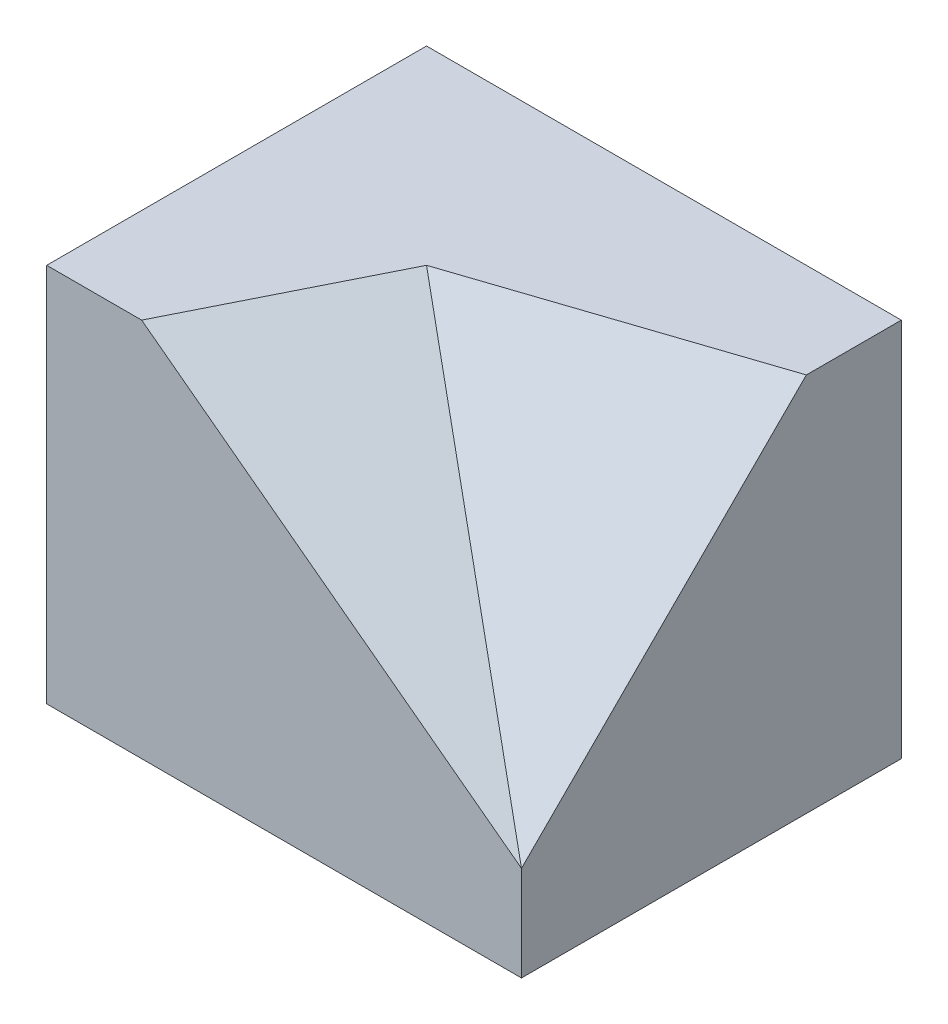
ISO-10303-21;
HEADER;
FILE_DESCRIPTION(('STEP AP214'),'2;1');
FILE_NAME('part.step','',(''),(''),'','','');
FILE_SCHEMA(('AUTOMOTIVE_DESIGN { 1 0 10303 214 1 1 1 1 }'));
ENDSEC;
DATA;
#1=APPLICATION_CONTEXT('core data for automotive mechanical design processes');
#2=APPLICATION_PROTOCOL_DEFINITION('international standard','automotive_design',2000,#1);
#3=PRODUCT_CONTEXT('',#1,'mechanical');
#4=PRODUCT('Part','Part','',(#3));
#5=PRODUCT_RELATED_PRODUCT_CATEGORY('part','',(#4));
#6=PRODUCT_DEFINITION_FORMATION('','',#4);
#7=PRODUCT_DEFINITION_CONTEXT('part definition',#1,'design');
#8=PRODUCT_DEFINITION('design','',#6,#7);
#9=PRODUCT_DEFINITION_SHAPE('','',#8);
#10=(LENGTH_UNIT() NAMED_UNIT(*) SI_UNIT(.MILLI.,.METRE.));
#11=(NAMED_UNIT(*) PLANE_ANGLE_UNIT() SI_UNIT($,.RADIAN.));
#12=(NAMED_UNIT(*) SI_UNIT($,.STERADIAN.) SOLID_ANGLE_UNIT());
#13=UNCERTAINTY_MEASURE_WITH_UNIT(LENGTH_MEASURE(1.E-05),#10,'distance_accuracy_value','');
#14=(GEOMETRIC_REPRESENTATION_CONTEXT(3) GLOBAL_UNCERTAINTY_ASSIGNED_CONTEXT((#13)) GLOBAL_UNIT_ASSIGNED_CONTEXT((#10,
#11,#12)) REPRESENTATION_CONTEXT('',''));
#15=CARTESIAN_POINT('',(0.,0.,0.));
#16=DIRECTION('',(0.,0.,1.));
#17=DIRECTION('',(1.,0.,0.));
#18=AXIS2_PLACEMENT_3D('',#15,#16,#17);
#19=CARTESIAN_POINT('',(12.5,20.,-10.));
#20=DIRECTION('',(-1.,0.,0.));
#21=DIRECTION('',(0.,0.,1.));
#22=AXIS2_PLACEMENT_3D('',#19,#20,#21);
#23=PLANE('',#22);
#24=DIRECTION('',(0.,0.707106781186547,-0.707106781186548));
#25=VECTOR('',#24,1.);
#26=CARTESIAN_POINT('',(12.5,5.,10.));
#27=LINE('',#26,#25);
#28=CARTESIAN_POINT('',(12.5,5.,10.));
#29=VERTEX_POINT('',#28);
#30=CARTESIAN_POINT('',(12.5,20.,-5.));
#31=VERTEX_POINT('',#30);
#32=EDGE_CURVE('E93',#29,#31,#27,.T.);
#33=ORIENTED_EDGE('',*,*,#32,.F.);
#34=DIRECTION('',(0.,-1.,0.));
#35=VECTOR('',#34,1.);
#36=CARTESIAN_POINT('',(12.5,20.,10.));
#37=LINE('',#36,#35);
#38=CARTESIAN_POINT('',(12.5,0.,10.));
#39=VERTEX_POINT('',#38);
#40=EDGE_CURVE('E41',#29,#39,#37,.T.);
#41=ORIENTED_EDGE('',*,*,#40,.T.);
#42=DIRECTION('',(0.,0.,-1.));
#43=VECTOR('',#42,1.);
#44=CARTESIAN_POINT('',(12.5,0.,-10.));
#45=LINE('',#44,#43);
#46=CARTESIAN_POINT('',(12.5,0.,-10.));
#47=VERTEX_POINT('',#46);
#48=EDGE_CURVE('E120',#39,#47,#45,.T.);
#49=ORIENTED_EDGE('',*,*,#48,.T.);
#50=DIRECTION('',(0.,-1.,0.));
#51=VECTOR('',#50,1.);
#52=CARTESIAN_POINT('',(12.5,20.,-10.));
#53=LINE('',#52,#51);
#54=CARTESIAN_POINT('',(12.5,20.,-10.));
#55=VERTEX_POINT('',#54);
#56=EDGE_CURVE('E113',#55,#47,#53,.T.);
#57=ORIENTED_EDGE('',*,*,#56,.F.);
#58=DIRECTION('',(0.,0.,-1.));
#59=VECTOR('',#58,1.);
#60=CARTESIAN_POINT('',(12.5,20.,-10.));
#61=LINE('',#60,#59);
#62=EDGE_CURVE('E105',#31,#55,#61,.T.);
#63=ORIENTED_EDGE('',*,*,#62,.F.);
#64=EDGE_LOOP('',(#33,#41,#49,#57,#63));
#65=FACE_BOUND('',#64,.T.);
#66=ADVANCED_FACE('F33',(#65),#23,.F.);
#67=CARTESIAN_POINT('',(0.,20.,0.));
#68=DIRECTION('',(0.,-1.,0.));
#69=DIRECTION('',(0.,0.,-1.));
#70=AXIS2_PLACEMENT_3D('',#67,#68,#69);
#71=PLANE('',#70);
#72=DIRECTION('',(-0.948683298050514,0.,0.316227766016838));
#73=VECTOR('',#72,1.);
#74=CARTESIAN_POINT('',(-2.49999999999999,20.,0.));
#75=LINE('',#74,#73);
#76=CARTESIAN_POINT('',(-2.50000000000001,20.,0.));
#77=VERTEX_POINT('',#76);
#78=EDGE_CURVE('E48',#31,#77,#75,.T.);
#79=ORIENTED_EDGE('',*,*,#78,.F.);
#80=ORIENTED_EDGE('',*,*,#62,.T.);
#81=DIRECTION('',(-1.,0.,0.));
#82=VECTOR('',#81,1.);
#83=CARTESIAN_POINT('',(12.5,20.,-10.));
#84=LINE('',#83,#82);
#85=CARTESIAN_POINT('',(-12.5,20.,-10.));
#86=VERTEX_POINT('',#85);
#87=EDGE_CURVE('E57',#55,#86,#84,.T.);
#88=ORIENTED_EDGE('',*,*,#87,.T.);
#89=DIRECTION('',(0.,0.,1.));
#90=VECTOR('',#89,1.);
#91=CARTESIAN_POINT('',(-12.5,20.,-10.));
#92=LINE('',#91,#90);
#93=CARTESIAN_POINT('',(-12.5,20.,10.));
#94=VERTEX_POINT('',#93);
#95=EDGE_CURVE('E119',#86,#94,#92,.T.);
#96=ORIENTED_EDGE('',*,*,#95,.T.);
#97=DIRECTION('',(1.,0.,0.));
#98=VECTOR('',#97,1.);
#99=CARTESIAN_POINT('',(12.5,20.,10.));
#100=LINE('',#99,#98);
#101=CARTESIAN_POINT('',(-7.50000000000001,20.,10.));
#102=VERTEX_POINT('',#101);
#103=EDGE_CURVE('E83',#94,#102,#100,.T.);
#104=ORIENTED_EDGE('',*,*,#103,.T.);
#105=DIRECTION('',(-0.447213595499958,0.,0.894427190999916));
#106=VECTOR('',#105,1.);
#107=CARTESIAN_POINT('',(-2.,20.,-1.));
#108=LINE('',#107,#106);
#109=EDGE_CURVE('E98',#77,#102,#108,.T.);
#110=ORIENTED_EDGE('',*,*,#109,.F.);
#111=EDGE_LOOP('',(#79,#80,#88,#96,#104,#110));
#112=FACE_BOUND('',#111,.T.);
#113=ADVANCED_FACE('F132',(#112),#71,.F.);
#114=CARTESIAN_POINT('',(-12.5,20.,-10.));
#115=DIRECTION('',(1.,0.,0.));
#116=DIRECTION('',(0.,0.,-1.));
#117=AXIS2_PLACEMENT_3D('',#114,#115,#116);
#118=PLANE('',#117);
#119=DIRECTION('',(0.,0.,1.));
#120=VECTOR('',#119,1.);
#121=CARTESIAN_POINT('',(-12.5,0.,-10.));
#122=LINE('',#121,#120);
#123=CARTESIAN_POINT('',(-12.5,0.,-10.));
#124=VERTEX_POINT('',#123);
#125=CARTESIAN_POINT('',(-12.5,0.,10.));
#126=VERTEX_POINT('',#125);
#127=EDGE_CURVE('E108',#124,#126,#122,.T.);
#128=ORIENTED_EDGE('',*,*,#127,.T.);
#129=DIRECTION('',(0.,-1.,0.));
#130=VECTOR('',#129,1.);
#131=CARTESIAN_POINT('',(-12.5,20.,10.));
#132=LINE('',#131,#130);
#133=EDGE_CURVE('E11',#94,#126,#132,.T.);
#134=ORIENTED_EDGE('',*,*,#133,.F.);
#135=ORIENTED_EDGE('',*,*,#95,.F.);
#136=DIRECTION('',(0.,-1.,0.));
#137=VECTOR('',#136,1.);
#138=CARTESIAN_POINT('',(-12.5,20.,-10.));
#139=LINE('',#138,#137);
#140=EDGE_CURVE('E114',#86,#124,#139,.T.);
#141=ORIENTED_EDGE('',*,*,#140,.T.);
#142=EDGE_LOOP('',(#128,#134,#135,#141));
#143=FACE_BOUND('',#142,.T.);
#144=ADVANCED_FACE('F35',(#143),#118,.F.);
#145=CARTESIAN_POINT('',(12.5,20.,10.));
#146=DIRECTION('',(0.,0.,-1.));
#147=DIRECTION('',(-1.,0.,0.));
#148=AXIS2_PLACEMENT_3D('',#145,#146,#147);
#149=PLANE('',#148);
#150=ORIENTED_EDGE('',*,*,#40,.F.);
#151=DIRECTION('',(0.8,-0.6,0.));
#152=VECTOR('',#151,1.);
#153=CARTESIAN_POINT('',(6.9,9.2,10.));
#154=LINE('',#153,#152);
#155=EDGE_CURVE('E97',#102,#29,#154,.T.);
#156=ORIENTED_EDGE('',*,*,#155,.F.);
#157=ORIENTED_EDGE('',*,*,#103,.F.);
#158=ORIENTED_EDGE('',*,*,#133,.T.);
#159=DIRECTION('',(1.,0.,0.));
#160=VECTOR('',#159,1.);
#161=CARTESIAN_POINT('',(12.5,0.,10.));
#162=LINE('',#161,#160);
#163=EDGE_CURVE('E111',#126,#39,#162,.T.);
#164=ORIENTED_EDGE('',*,*,#163,.T.);
#165=EDGE_LOOP('',(#150,#156,#157,#158,#164));
#166=FACE_BOUND('',#165,.T.);
#167=ADVANCED_FACE('F110',(#166),#149,.F.);
#168=CARTESIAN_POINT('',(12.5,20.,-10.));
#169=DIRECTION('',(0.,0.,1.));
#170=DIRECTION('',(1.,0.,0.));
#171=AXIS2_PLACEMENT_3D('',#168,#169,#170);
#172=PLANE('',#171);
#173=DIRECTION('',(-1.,0.,0.));
#174=VECTOR('',#173,1.);
#175=CARTESIAN_POINT('',(12.5,0.,-10.));
#176=LINE('',#175,#174);
#177=EDGE_CURVE('E77',#47,#124,#176,.T.);
#178=ORIENTED_EDGE('',*,*,#177,.T.);
#179=ORIENTED_EDGE('',*,*,#140,.F.);
#180=ORIENTED_EDGE('',*,*,#87,.F.);
#181=ORIENTED_EDGE('',*,*,#56,.T.);
#182=EDGE_LOOP('',(#178,#179,#180,#181));
#183=FACE_BOUND('',#182,.T.);
#184=ADVANCED_FACE('F137',(#183),#172,.F.);
#185=CARTESIAN_POINT('',(0.,0.,0.));
#186=DIRECTION('',(0.,-1.,0.));
#187=DIRECTION('',(0.,0.,-1.));
#188=AXIS2_PLACEMENT_3D('',#185,#186,#187);
#189=PLANE('',#188);
#190=ORIENTED_EDGE('',*,*,#127,.F.);
#191=ORIENTED_EDGE('',*,*,#177,.F.);
#192=ORIENTED_EDGE('',*,*,#48,.F.);
#193=ORIENTED_EDGE('',*,*,#163,.F.);
#194=EDGE_LOOP('',(#190,#191,#192,#193));
#195=FACE_BOUND('',#194,.T.);
#196=ADVANCED_FACE('F136',(#195),#189,.T.);
#197=CARTESIAN_POINT('',(7.98165137614679,10.6422018348624,3.9908256880734));
#198=DIRECTION('',(-0.574695771132691,-0.766261028176921,-0.287347885566345));
#199=DIRECTION('',(0.8,-0.6,0.));
#200=AXIS2_PLACEMENT_3D('',#197,#198,#199);
#201=PLANE('',#200);
#202=ORIENTED_EDGE('',*,*,#109,.T.);
#203=ORIENTED_EDGE('',*,*,#155,.T.);
#204=DIRECTION('',(0.639602149066832,-0.639602149066831,0.426401432711221));
#205=VECTOR('',#204,1.);
#206=CARTESIAN_POINT('',(6.70454545454545,10.7954545454545,6.13636363636363));
#207=LINE('',#206,#205);
#208=EDGE_CURVE('E90',#77,#29,#207,.T.);
#209=ORIENTED_EDGE('',*,*,#208,.F.);
#210=EDGE_LOOP('',(#202,#203,#209));
#211=FACE_BOUND('',#210,.T.);
#212=ADVANCED_FACE('F107',(#211),#201,.F.);
#213=CARTESIAN_POINT('',(3.02631578947369,9.07894736842105,9.07894736842105));
#214=DIRECTION('',(0.229415733870562,0.688247201611685,0.688247201611685));
#215=DIRECTION('',(0.,-0.707106781186547,0.707106781186548));
#216=AXIS2_PLACEMENT_3D('',#213,#214,#215);
#217=PLANE('',#216);
#218=ORIENTED_EDGE('',*,*,#208,.T.);
#219=ORIENTED_EDGE('',*,*,#32,.T.);
#220=ORIENTED_EDGE('',*,*,#78,.T.);
#221=EDGE_LOOP('',(#218,#219,#220));
#222=FACE_BOUND('',#221,.T.);
#223=ADVANCED_FACE('F92',(#222),#217,.T.);
#224=CLOSED_SHELL('',(#66,#113,#144,#167,#184,#196,#212,#223));
#225=MANIFOLD_SOLID_BREP('B2',#224);
#226=ADVANCED_BREP_SHAPE_REPRESENTATION('',(#18,#225),#14);
#227=SHAPE_DEFINITION_REPRESENTATION(#9,#226);
ENDSEC;
END-ISO-10303-21;
